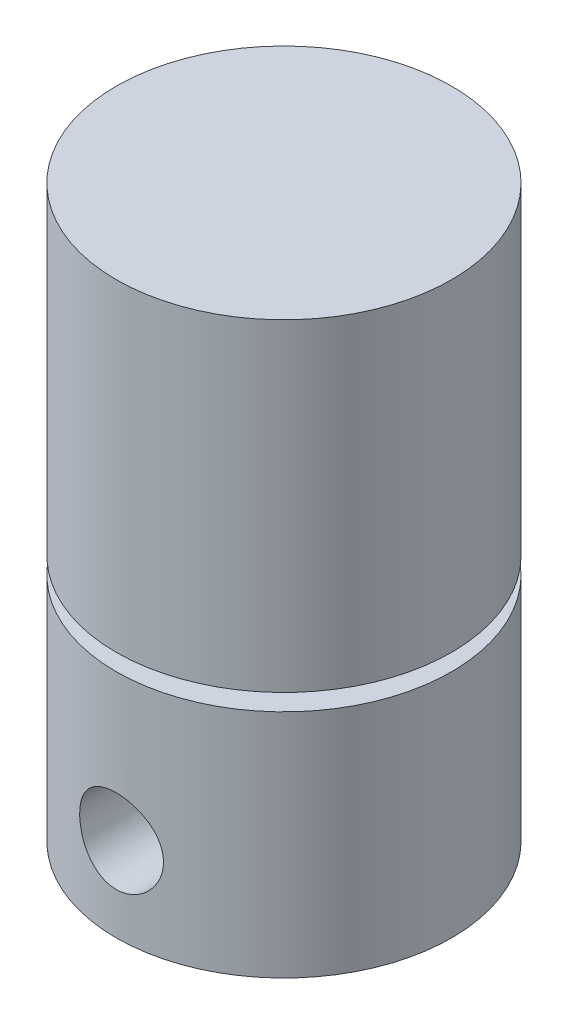
ISO-10303-21;
HEADER;
FILE_DESCRIPTION(('STEP AP214'),'2;1');
FILE_NAME('part.step','',(''),(''),'','','');
FILE_SCHEMA(('AUTOMOTIVE_DESIGN { 1 0 10303 214 1 1 1 1 }'));
ENDSEC;
DATA;
#1=APPLICATION_CONTEXT('core data for automotive mechanical design processes');
#2=APPLICATION_PROTOCOL_DEFINITION('international standard','automotive_design',2000,#1);
#3=PRODUCT_CONTEXT('',#1,'mechanical');
#4=PRODUCT('Part','Part','',(#3));
#5=PRODUCT_RELATED_PRODUCT_CATEGORY('part','',(#4));
#6=PRODUCT_DEFINITION_FORMATION('','',#4);
#7=PRODUCT_DEFINITION_CONTEXT('part definition',#1,'design');
#8=PRODUCT_DEFINITION('design','',#6,#7);
#9=PRODUCT_DEFINITION_SHAPE('','',#8);
#10=(LENGTH_UNIT() NAMED_UNIT(*) SI_UNIT(.MILLI.,.METRE.));
#11=(NAMED_UNIT(*) PLANE_ANGLE_UNIT() SI_UNIT($,.RADIAN.));
#12=(NAMED_UNIT(*) SI_UNIT($,.STERADIAN.) SOLID_ANGLE_UNIT());
#13=UNCERTAINTY_MEASURE_WITH_UNIT(LENGTH_MEASURE(1.E-05),#10,'distance_accuracy_value','');
#14=(GEOMETRIC_REPRESENTATION_CONTEXT(3) GLOBAL_UNCERTAINTY_ASSIGNED_CONTEXT((#13)) GLOBAL_UNIT_ASSIGNED_CONTEXT((#10,
#11,#12)) REPRESENTATION_CONTEXT('',''));
#15=CARTESIAN_POINT('',(0.,0.,0.));
#16=DIRECTION('',(0.,0.,1.));
#17=DIRECTION('',(1.,0.,0.));
#18=AXIS2_PLACEMENT_3D('',#15,#16,#17);
#19=CARTESIAN_POINT('',(0.,17.4625,0.));
#20=DIRECTION('',(0.,-1.,0.));
#21=DIRECTION('',(0.,0.,-1.));
#22=AXIS2_PLACEMENT_3D('',#19,#20,#21);
#23=CYLINDRICAL_SURFACE('',#22,12.7);
#24=CARTESIAN_POINT('',(3.175,6.35,-12.2967221242085));
#25=CARTESIAN_POINT('',(3.1749950198132,6.17467554632325,-12.2967254711158));
#26=CARTESIAN_POINT('',(3.16042833178202,5.99929597867828,-12.3005126863854));
#27=CARTESIAN_POINT('',(3.10263936933902,5.65357317571964,-12.3152136473056));
#28=CARTESIAN_POINT('',(3.05940041756247,5.4832329318254,-12.3261315404947));
#29=CARTESIAN_POINT('',(2.94575382353269,5.15263950650228,-12.3537818023711));
#30=CARTESIAN_POINT('',(2.8753812543752,4.99237361266015,-12.3705066621688));
#31=CARTESIAN_POINT('',(2.70957184940196,4.68590521727435,-12.4078770387652));
#32=CARTESIAN_POINT('',(2.61413394947207,4.53970331315812,-12.4285227220068));
#33=CARTESIAN_POINT('',(2.39865970268609,4.26229571051699,-12.4719170977164));
#34=CARTESIAN_POINT('',(2.27817284738414,4.13144512755544,-12.4946993898125));
#35=CARTESIAN_POINT('',(2.01699122140784,3.89158302916237,-12.5395085190442));
#36=CARTESIAN_POINT('',(1.87629456360899,3.78257355546038,-12.5615352853931));
#37=CARTESIAN_POINT('',(1.57625440537027,3.58803515610828,-12.6027232771114));
#38=CARTESIAN_POINT('',(1.4166781117678,3.50285508703494,-12.6218402299875));
#39=CARTESIAN_POINT('',(1.08491424405181,3.36066175192558,-12.65467131146));
#40=CARTESIAN_POINT('',(0.912728534955764,3.3036443300673,-12.6683862371462));
#41=CARTESIAN_POINT('',(0.564335623617785,3.2205322500852,-12.6886304373719));
#42=CARTESIAN_POINT('',(0.388280553827199,3.19383455170524,-12.6952996518228));
#43=CARTESIAN_POINT('',(0.0340726004637171,3.17022685832005,-12.7011886451627));
#44=CARTESIAN_POINT('',(-0.144079969063347,3.17331245929381,-12.7004095254281));
#45=CARTESIAN_POINT('',(-0.493243384772329,3.20875005981768,-12.6915938059099));
#46=CARTESIAN_POINT('',(-0.664324984533387,3.2404511328184,-12.6837186297291));
#47=CARTESIAN_POINT('',(-0.998658935538454,3.33117351296159,-12.6617836238657));
#48=CARTESIAN_POINT('',(-1.16191086950114,3.39019627442931,-12.6477234649603));
#49=CARTESIAN_POINT('',(-1.47766628361824,3.53441326477257,-12.6147513732012));
#50=CARTESIAN_POINT('',(-1.63005931850865,3.61983914672042,-12.5957967501266));
#51=CARTESIAN_POINT('',(-1.91857510093105,3.81426171247765,-12.5550917783831));
#52=CARTESIAN_POINT('',(-2.05469501139648,3.923262497072,-12.5333409435887));
#53=CARTESIAN_POINT('',(-2.31068256139473,4.16523010231761,-12.4887191648708));
#54=CARTESIAN_POINT('',(-2.43001063106375,4.29876571328164,-12.4658338379713));
#55=CARTESIAN_POINT('',(-2.64469999368259,4.58419196639616,-12.4220610526701));
#56=CARTESIAN_POINT('',(-2.74006016644614,4.7360834659537,-12.4011736876753));
#57=CARTESIAN_POINT('',(-2.90445230964671,5.05496834336905,-12.3637103097324));
#58=CARTESIAN_POINT('',(-2.97335437513118,5.22203137749726,-12.347155693206));
#59=CARTESIAN_POINT('',(-3.08192684552051,5.56588354445759,-12.3205067298881));
#60=CARTESIAN_POINT('',(-3.12160350580598,5.74267058726044,-12.3104110007027));
#61=CARTESIAN_POINT('',(-3.16970364110572,6.095948566943,-12.2981130212947));
#62=CARTESIAN_POINT('',(-3.17892490187728,6.2723239975431,-12.2957093300071));
#63=CARTESIAN_POINT('',(-3.16803657795425,6.62409385946327,-12.2985192607316));
#64=CARTESIAN_POINT('',(-3.14792969326925,6.79948837959579,-12.3037321815428));
#65=CARTESIAN_POINT('',(-3.07965533920158,7.14135511648469,-12.3209949412092));
#66=CARTESIAN_POINT('',(-3.03195236671802,7.30792636274288,-12.3329315220802));
#67=CARTESIAN_POINT('',(-2.91035496372149,7.63070795147373,-12.3621891219376));
#68=CARTESIAN_POINT('',(-2.83645743059488,7.78691706400085,-12.3795107787294));
#69=CARTESIAN_POINT('',(-2.66289874827948,8.08792042289096,-12.418010941113));
#70=CARTESIAN_POINT('',(-2.56276062737126,8.23243062685459,-12.439258441312));
#71=CARTESIAN_POINT('',(-2.34016643006688,8.50288922075787,-12.4830469550031));
#72=CARTESIAN_POINT('',(-2.21770668600727,8.62883455414564,-12.5055881806495));
#73=CARTESIAN_POINT('',(-1.95028413912651,8.86182002406507,-12.5501070185035));
#74=CARTESIAN_POINT('',(-1.80483494928781,8.96830827943698,-12.5720564161859));
#75=CARTESIAN_POINT('',(-1.49765601755559,9.15534855102809,-12.6123346509939));
#76=CARTESIAN_POINT('',(-1.33592712544035,9.23590192009242,-12.6306636769502));
#77=CARTESIAN_POINT('',(-1.00189729049621,9.36808646385047,-12.6615204698767));
#78=CARTESIAN_POINT('',(-0.829682684763527,9.41992564116141,-12.6740898412846));
#79=CARTESIAN_POINT('',(-0.478630489012213,9.49383462495269,-12.6921932261265));
#80=CARTESIAN_POINT('',(-0.299794184005939,9.51591017659858,-12.6977285972965));
#81=CARTESIAN_POINT('',(0.0542401964575508,9.52934209690234,-12.7010848787296));
#82=CARTESIAN_POINT('',(0.229405900617119,9.52151292637792,-12.6991103294396));
#83=CARTESIAN_POINT('',(0.575841801116834,9.47722314834044,-12.6881222125238));
#84=CARTESIAN_POINT('',(0.747112113154448,9.44076339233319,-12.6791088542401));
#85=CARTESIAN_POINT('',(1.08004303817216,9.34068420222751,-12.655087493111));
#86=CARTESIAN_POINT('',(1.24175042029424,9.27721203572685,-12.640112022951));
#87=CARTESIAN_POINT('',(1.55231164340716,9.12504341161286,-12.6057434230086));
#88=CARTESIAN_POINT('',(1.70116386101839,9.03634377427121,-12.5863497364056));
#89=CARTESIAN_POINT('',(1.98565112274399,8.83375413206227,-12.5446551773491));
#90=CARTESIAN_POINT('',(2.12088408784722,8.71931154628034,-12.5222957878978));
#91=CARTESIAN_POINT('',(2.37050268936837,8.46955744497192,-12.4774531075658));
#92=CARTESIAN_POINT('',(2.48488303211817,8.33424064634706,-12.4549697867118));
#93=CARTESIAN_POINT('',(2.69164443404806,8.04354050994846,-12.4119473580947));
#94=CARTESIAN_POINT('',(2.783575266647,7.88782990831532,-12.3914523466269));
#95=CARTESIAN_POINT('',(2.93981789665887,7.56267381964745,-12.3553205869608));
#96=CARTESIAN_POINT('',(3.00414978846308,7.39323843265204,-12.3396803064045));
#97=CARTESIAN_POINT('',(3.09379152821293,7.07841798742337,-12.3174731028359));
#98=CARTESIAN_POINT('',(3.12417831664509,6.93453920307402,-12.3097500503611));
#99=CARTESIAN_POINT('',(3.16478377891537,6.64378634093234,-12.2993733749982));
#100=CARTESIAN_POINT('',(3.17500417313031,6.49691251972402,-12.2967193196792));
#101=CARTESIAN_POINT('',(3.175,6.35,-12.2967221242085));
#102=B_SPLINE_CURVE_WITH_KNOTS('',3,(#24,#25,#26,#27,#28,#29,#30,#31,#32,#33,#34,#35,#36,#37,
#38,#39,#40,#41,#42,#43,#44,#45,#46,#47,#48,#49,#50,#51,#52,#53,#54,#55,#56,#57,#58,#59,#60,#61,
#62,#63,#64,#65,#66,#67,#68,#69,#70,#71,#72,#73,#74,#75,#76,#77,#78,#79,#80,#81,#82,#83,#84,#85,
#86,#87,#88,#89,#90,#91,#92,#93,#94,#95,#96,#97,#98,#99,#100,#101),.UNSPECIFIED.,.T.,.F.,(4,2,2,
2,2,2,2,2,2,2,2,2,2,2,2,2,2,2,2,2,2,2,2,2,2,2,2,2,2,2,2,2,2,2,2,2,2,2,4),(0.,0.525433851004893,
1.05117359161441,1.57623602350085,2.10132074979458,2.6368242182508,3.1723777227943,
3.71540400425358,4.25835013005807,4.7902971376409,5.32216548805846,5.84223193614963,
6.36232607040478,6.88711950303144,7.4120042954552,7.95109492546328,8.49021074623749,
9.03194068650671,9.57355464164525,10.1008633995054,10.6281236152971,11.1467570436797,
11.6654519221148,12.1943221424741,12.7232793399029,13.2654717033223,13.8076357797011,
14.3458193247108,14.8838989712076,15.4074297658815,15.9309449907505,16.4516419323711,
16.9724045329363,17.5056431266551,18.0390169009448,18.5823412615974,19.1252693614627,
19.5655924052587,20.0058778838705),.UNSPECIFIED.);
#103=CARTESIAN_POINT('',(3.175,6.35,-12.2967221242085));
#104=VERTEX_POINT('',#103);
#105=EDGE_CURVE('E61',#104,#104,#102,.T.);
#106=ORIENTED_EDGE('',*,*,#105,.F.);
#107=EDGE_LOOP('',(#106));
#108=FACE_BOUND('',#107,.T.);
#109=CARTESIAN_POINT('',(0.,17.4625,0.));
#110=DIRECTION('',(0.,1.,0.));
#111=DIRECTION('',(0.,0.,1.));
#112=AXIS2_PLACEMENT_3D('',#109,#110,#111);
#113=CIRCLE('',#112,12.7);
#114=CARTESIAN_POINT('',(0.,17.4625,12.7));
#115=VERTEX_POINT('',#114);
#116=EDGE_CURVE('E37',#115,#115,#113,.T.);
#117=ORIENTED_EDGE('',*,*,#116,.F.);
#118=EDGE_LOOP('',(#117));
#119=FACE_BOUND('',#118,.T.);
#120=CARTESIAN_POINT('',(0.,0.,0.));
#121=DIRECTION('',(0.,1.,0.));
#122=DIRECTION('',(0.,0.,1.));
#123=AXIS2_PLACEMENT_3D('',#120,#121,#122);
#124=CIRCLE('',#123,12.7);
#125=CARTESIAN_POINT('',(0.,0.,12.7));
#126=VERTEX_POINT('',#125);
#127=EDGE_CURVE('E33',#126,#126,#124,.T.);
#128=ORIENTED_EDGE('',*,*,#127,.T.);
#129=EDGE_LOOP('',(#128));
#130=FACE_BOUND('',#129,.T.);
#131=CARTESIAN_POINT('',(-3.175,6.35,12.2967221242085));
#132=CARTESIAN_POINT('',(-3.1749950198132,6.52532445367675,12.2967254711158));
#133=CARTESIAN_POINT('',(-3.16042833178202,6.70070402132172,12.3005126863854));
#134=CARTESIAN_POINT('',(-3.10263936933902,7.04642682428036,12.3152136473056));
#135=CARTESIAN_POINT('',(-3.05940041756247,7.21676706817459,12.3261315404947));
#136=CARTESIAN_POINT('',(-2.94575382353269,7.54736049349772,12.3537818023711));
#137=CARTESIAN_POINT('',(-2.8753812543752,7.70762638733985,12.3705066621688));
#138=CARTESIAN_POINT('',(-2.70957184940196,8.01409478272565,12.4078770387652));
#139=CARTESIAN_POINT('',(-2.61413394947207,8.16029668684188,12.4285227220068));
#140=CARTESIAN_POINT('',(-2.39865970268609,8.43770428948301,12.4719170977164));
#141=CARTESIAN_POINT('',(-2.27817284738414,8.56855487244456,12.4946993898125));
#142=CARTESIAN_POINT('',(-2.01699122140784,8.80841697083763,12.5395085190442));
#143=CARTESIAN_POINT('',(-1.87629456360899,8.91742644453962,12.5615352853931));
#144=CARTESIAN_POINT('',(-1.57625440537027,9.11196484389172,12.6027232771114));
#145=CARTESIAN_POINT('',(-1.4166781117678,9.19714491296506,12.6218402299875));
#146=CARTESIAN_POINT('',(-1.08491424405181,9.33933824807441,12.65467131146));
#147=CARTESIAN_POINT('',(-0.912728534955763,9.3963556699327,12.6683862371462));
#148=CARTESIAN_POINT('',(-0.564335623617784,9.4794677499148,12.6886304373719));
#149=CARTESIAN_POINT('',(-0.388280553827198,9.50616544829476,12.6952996518228));
#150=CARTESIAN_POINT('',(-0.0340726004637166,9.52977314167995,12.7011886451627));
#151=CARTESIAN_POINT('',(0.144079969063347,9.52668754070619,12.7004095254281));
#152=CARTESIAN_POINT('',(0.493243384772329,9.49124994018232,12.6915938059099));
#153=CARTESIAN_POINT('',(0.664324984533387,9.4595488671816,12.6837186297291));
#154=CARTESIAN_POINT('',(0.998658935538454,9.3688264870384,12.6617836238657));
#155=CARTESIAN_POINT('',(1.16191086950114,9.30980372557069,12.6477234649603));
#156=CARTESIAN_POINT('',(1.47766628361824,9.16558673522743,12.6147513732012));
#157=CARTESIAN_POINT('',(1.63005931850865,9.08016085327958,12.5957967501266));
#158=CARTESIAN_POINT('',(1.91857510093105,8.88573828752235,12.5550917783831));
#159=CARTESIAN_POINT('',(2.05469501139648,8.776737502928,12.5333409435887));
#160=CARTESIAN_POINT('',(2.31068256139473,8.53476989768239,12.4887191648708));
#161=CARTESIAN_POINT('',(2.43001063106375,8.40123428671837,12.4658338379713));
#162=CARTESIAN_POINT('',(2.64469999368259,8.11580803360384,12.4220610526701));
#163=CARTESIAN_POINT('',(2.74006016644614,7.9639165340463,12.4011736876753));
#164=CARTESIAN_POINT('',(2.90445230964671,7.64503165663095,12.3637103097324));
#165=CARTESIAN_POINT('',(2.97335437513118,7.47796862250274,12.347155693206));
#166=CARTESIAN_POINT('',(3.08192684552051,7.13411645554241,12.3205067298881));
#167=CARTESIAN_POINT('',(3.12160350580598,6.95732941273956,12.3104110007027));
#168=CARTESIAN_POINT('',(3.16970364110572,6.604051433057,12.2981130212947));
#169=CARTESIAN_POINT('',(3.17892490187728,6.4276760024569,12.2957093300071));
#170=CARTESIAN_POINT('',(3.16803657795425,6.07590614053673,12.2985192607316));
#171=CARTESIAN_POINT('',(3.14792969326925,5.90051162040421,12.3037321815428));
#172=CARTESIAN_POINT('',(3.07965533920158,5.55864488351531,12.3209949412092));
#173=CARTESIAN_POINT('',(3.03195236671802,5.39207363725712,12.3329315220802));
#174=CARTESIAN_POINT('',(2.91035496372149,5.06929204852627,12.3621891219376));
#175=CARTESIAN_POINT('',(2.83645743059488,4.91308293599915,12.3795107787294));
#176=CARTESIAN_POINT('',(2.66289874827948,4.61207957710904,12.418010941113));
#177=CARTESIAN_POINT('',(2.56276062737126,4.46756937314542,12.439258441312));
#178=CARTESIAN_POINT('',(2.34016643006688,4.19711077924213,12.4830469550031));
#179=CARTESIAN_POINT('',(2.21770668600727,4.07116544585436,12.5055881806495));
#180=CARTESIAN_POINT('',(1.95028413912651,3.83817997593493,12.5501070185035));
#181=CARTESIAN_POINT('',(1.80483494928781,3.73169172056302,12.5720564161859));
#182=CARTESIAN_POINT('',(1.49765601755559,3.54465144897191,12.6123346509939));
#183=CARTESIAN_POINT('',(1.33592712544035,3.46409807990758,12.6306636769502));
#184=CARTESIAN_POINT('',(1.00189729049621,3.33191353614953,12.6615204698767));
#185=CARTESIAN_POINT('',(0.829682684763526,3.28007435883859,12.6740898412846));
#186=CARTESIAN_POINT('',(0.478630489012213,3.20616537504731,12.6921932261265));
#187=CARTESIAN_POINT('',(0.299794184005939,3.18408982340142,12.6977285972965));
#188=CARTESIAN_POINT('',(-0.0542401964575509,3.17065790309766,12.7010848787296));
#189=CARTESIAN_POINT('',(-0.229405900617119,3.17848707362208,12.6991103294396));
#190=CARTESIAN_POINT('',(-0.575841801116834,3.22277685165956,12.6881222125238));
#191=CARTESIAN_POINT('',(-0.747112113154448,3.25923660766681,12.6791088542401));
#192=CARTESIAN_POINT('',(-1.08004303817216,3.35931579777248,12.655087493111));
#193=CARTESIAN_POINT('',(-1.24175042029424,3.42278796427315,12.640112022951));
#194=CARTESIAN_POINT('',(-1.55231164340716,3.57495658838714,12.6057434230086));
#195=CARTESIAN_POINT('',(-1.70116386101839,3.66365622572879,12.5863497364056));
#196=CARTESIAN_POINT('',(-1.98565112274399,3.86624586793772,12.5446551773491));
#197=CARTESIAN_POINT('',(-2.12088408784722,3.98068845371966,12.5222957878978));
#198=CARTESIAN_POINT('',(-2.37050268936837,4.23044255502808,12.4774531075658));
#199=CARTESIAN_POINT('',(-2.48488303211817,4.36575935365294,12.4549697867118));
#200=CARTESIAN_POINT('',(-2.69164443404806,4.65645949005154,12.4119473580947));
#201=CARTESIAN_POINT('',(-2.783575266647,4.81217009168468,12.3914523466269));
#202=CARTESIAN_POINT('',(-2.93981789665886,5.13732618035255,12.3553205869608));
#203=CARTESIAN_POINT('',(-3.00414978846308,5.30676156734796,12.3396803064045));
#204=CARTESIAN_POINT('',(-3.09379152821293,5.62158201257663,12.3174731028359));
#205=CARTESIAN_POINT('',(-3.12417831664509,5.76546079692598,12.3097500503611));
#206=CARTESIAN_POINT('',(-3.16478377891537,6.05621365906766,12.2993733749982));
#207=CARTESIAN_POINT('',(-3.17500417313031,6.20308748027598,12.2967193196792));
#208=CARTESIAN_POINT('',(-3.175,6.35,12.2967221242085));
#209=B_SPLINE_CURVE_WITH_KNOTS('',3,(#131,#132,#133,#134,#135,#136,#137,#138,#139,#140,#141,
#142,#143,#144,#145,#146,#147,#148,#149,#150,#151,#152,#153,#154,#155,#156,#157,#158,#159,#160,
#161,#162,#163,#164,#165,#166,#167,#168,#169,#170,#171,#172,#173,#174,#175,#176,#177,#178,#179,
#180,#181,#182,#183,#184,#185,#186,#187,#188,#189,#190,#191,#192,#193,#194,#195,#196,#197,#198,
#199,#200,#201,#202,#203,#204,#205,#206,#207,#208),.UNSPECIFIED.,.T.,.F.,(4,2,2,2,2,2,2,2,2,2,2,
2,2,2,2,2,2,2,2,2,2,2,2,2,2,2,2,2,2,2,2,2,2,2,2,2,2,2,4),(0.,0.525433851004893,1.05117359161441,
1.57623602350085,2.10132074979458,2.6368242182508,3.1723777227943,3.71540400425358,
4.25835013005807,4.7902971376409,5.32216548805846,5.84223193614962,6.36232607040478,
6.88711950303144,7.4120042954552,7.95109492546327,8.49021074623748,9.03194068650671,
9.57355464164525,10.1008633995054,10.6281236152971,11.1467570436797,11.6654519221148,
12.1943221424741,12.7232793399029,13.2654717033223,13.8076357797011,14.3458193247108,
14.8838989712076,15.4074297658815,15.9309449907505,16.4516419323711,16.9724045329363,
17.5056431266551,18.0390169009448,18.5823412615974,19.1252693614627,19.5655924052587,
20.0058778838705),.UNSPECIFIED.);
#210=CARTESIAN_POINT('',(-3.175,6.35,12.2967221242085));
#211=VERTEX_POINT('',#210);
#212=EDGE_CURVE('E53',#211,#211,#209,.T.);
#213=ORIENTED_EDGE('',*,*,#212,.T.);
#214=EDGE_LOOP('',(#213));
#215=FACE_BOUND('',#214,.T.);
#216=ADVANCED_FACE('F30',(#108,#119,#130,#215),#23,.T.);
#217=CARTESIAN_POINT('',(0.,17.4625,0.));
#218=DIRECTION('',(0.,1.,0.));
#219=DIRECTION('',(0.,0.,1.));
#220=AXIS2_PLACEMENT_3D('',#217,#218,#219);
#221=PLANE('',#220);
#222=CARTESIAN_POINT('',(0.,17.4625,0.));
#223=DIRECTION('',(0.,1.,0.));
#224=DIRECTION('',(0.,0.,1.));
#225=AXIS2_PLACEMENT_3D('',#222,#223,#224);
#226=CIRCLE('',#225,9.525);
#227=CARTESIAN_POINT('',(0.,17.4625,9.525));
#228=VERTEX_POINT('',#227);
#229=EDGE_CURVE('E10',#228,#228,#226,.T.);
#230=ORIENTED_EDGE('',*,*,#229,.F.);
#231=EDGE_LOOP('',(#230));
#232=FACE_BOUND('',#231,.T.);
#233=ORIENTED_EDGE('',*,*,#116,.T.);
#234=EDGE_LOOP('',(#233));
#235=FACE_BOUND('',#234,.T.);
#236=ADVANCED_FACE('F85',(#232,#235),#221,.T.);
#237=CARTESIAN_POINT('',(0.,0.,0.));
#238=DIRECTION('',(0.,1.,0.));
#239=DIRECTION('',(0.,0.,1.));
#240=AXIS2_PLACEMENT_3D('',#237,#238,#239);
#241=PLANE('',#240);
#242=CARTESIAN_POINT('',(9.525,0.,0.));
#243=DIRECTION('',(0.,-1.,0.));
#244=DIRECTION('',(0.,0.,-1.));
#245=AXIS2_PLACEMENT_3D('',#242,#243,#244);
#246=CIRCLE('',#245,1.5875);
#247=CARTESIAN_POINT('',(9.525,0.,-1.5875));
#248=VERTEX_POINT('',#247);
#249=EDGE_CURVE('E229',#248,#248,#246,.T.);
#250=ORIENTED_EDGE('',*,*,#249,.F.);
#251=EDGE_LOOP('',(#250));
#252=FACE_BOUND('',#251,.T.);
#253=CARTESIAN_POINT('',(-9.525,0.,0.));
#254=DIRECTION('',(0.,-1.,0.));
#255=DIRECTION('',(0.,0.,1.));
#256=AXIS2_PLACEMENT_3D('',#253,#254,#255);
#257=CIRCLE('',#256,1.5875);
#258=CARTESIAN_POINT('',(-9.525,0.,1.5875));
#259=VERTEX_POINT('',#258);
#260=EDGE_CURVE('E223',#259,#259,#257,.T.);
#261=ORIENTED_EDGE('',*,*,#260,.F.);
#262=EDGE_LOOP('',(#261));
#263=FACE_BOUND('',#262,.T.);
#264=ORIENTED_EDGE('',*,*,#127,.F.);
#265=EDGE_LOOP('',(#264));
#266=FACE_BOUND('',#265,.T.);
#267=ADVANCED_FACE('F90',(#252,#263,#266),#241,.F.);
#268=CARTESIAN_POINT('',(0.,18.7325,0.));
#269=DIRECTION('',(0.,-1.,0.));
#270=DIRECTION('',(0.,0.,-1.));
#271=AXIS2_PLACEMENT_3D('',#268,#269,#270);
#272=CYLINDRICAL_SURFACE('',#271,9.525);
#273=CARTESIAN_POINT('',(0.,18.7325,0.));
#274=DIRECTION('',(0.,1.,0.));
#275=DIRECTION('',(0.,0.,1.));
#276=AXIS2_PLACEMENT_3D('',#273,#274,#275);
#277=CIRCLE('',#276,9.525);
#278=CARTESIAN_POINT('',(0.,18.7325,9.525));
#279=VERTEX_POINT('',#278);
#280=EDGE_CURVE('E43',#279,#279,#277,.T.);
#281=ORIENTED_EDGE('',*,*,#280,.F.);
#282=EDGE_LOOP('',(#281));
#283=FACE_BOUND('',#282,.T.);
#284=ORIENTED_EDGE('',*,*,#229,.T.);
#285=EDGE_LOOP('',(#284));
#286=FACE_BOUND('',#285,.T.);
#287=ADVANCED_FACE('F105',(#283,#286),#272,.T.);
#288=CARTESIAN_POINT('',(0.,43.18,0.));
#289=DIRECTION('',(0.,-1.,0.));
#290=DIRECTION('',(0.,0.,-1.));
#291=AXIS2_PLACEMENT_3D('',#288,#289,#290);
#292=CYLINDRICAL_SURFACE('',#291,12.7);
#293=CARTESIAN_POINT('',(0.,43.18,0.));
#294=DIRECTION('',(0.,1.,0.));
#295=DIRECTION('',(0.,0.,1.));
#296=AXIS2_PLACEMENT_3D('',#293,#294,#295);
#297=CIRCLE('',#296,12.7);
#298=CARTESIAN_POINT('',(0.,43.18,12.7));
#299=VERTEX_POINT('',#298);
#300=EDGE_CURVE('E46',#299,#299,#297,.T.);
#301=ORIENTED_EDGE('',*,*,#300,.F.);
#302=EDGE_LOOP('',(#301));
#303=FACE_BOUND('',#302,.T.);
#304=CARTESIAN_POINT('',(0.,18.7325,0.));
#305=DIRECTION('',(0.,1.,0.));
#306=DIRECTION('',(0.,0.,1.));
#307=AXIS2_PLACEMENT_3D('',#304,#305,#306);
#308=CIRCLE('',#307,12.7);
#309=CARTESIAN_POINT('',(0.,18.7325,12.7));
#310=VERTEX_POINT('',#309);
#311=EDGE_CURVE('E47',#310,#310,#308,.T.);
#312=ORIENTED_EDGE('',*,*,#311,.T.);
#313=EDGE_LOOP('',(#312));
#314=FACE_BOUND('',#313,.T.);
#315=ADVANCED_FACE('F110',(#303,#314),#292,.T.);
#316=CARTESIAN_POINT('',(0.,43.18,0.));
#317=DIRECTION('',(0.,1.,0.));
#318=DIRECTION('',(0.,0.,1.));
#319=AXIS2_PLACEMENT_3D('',#316,#317,#318);
#320=PLANE('',#319);
#321=ORIENTED_EDGE('',*,*,#300,.T.);
#322=EDGE_LOOP('',(#321));
#323=FACE_BOUND('',#322,.T.);
#324=ADVANCED_FACE('F118',(#323),#320,.T.);
#325=CARTESIAN_POINT('',(0.,18.7325,0.));
#326=DIRECTION('',(0.,1.,0.));
#327=DIRECTION('',(0.,0.,1.));
#328=AXIS2_PLACEMENT_3D('',#325,#326,#327);
#329=PLANE('',#328);
#330=ORIENTED_EDGE('',*,*,#280,.T.);
#331=EDGE_LOOP('',(#330));
#332=FACE_BOUND('',#331,.T.);
#333=ORIENTED_EDGE('',*,*,#311,.F.);
#334=EDGE_LOOP('',(#333));
#335=FACE_BOUND('',#334,.T.);
#336=ADVANCED_FACE('F81',(#332,#335),#329,.F.);
#337=CARTESIAN_POINT('',(0.,6.35,12.701));
#338=DIRECTION('',(0.,0.,-1.));
#339=DIRECTION('',(-1.,0.,0.));
#340=AXIS2_PLACEMENT_3D('',#337,#338,#339);
#341=CYLINDRICAL_SURFACE('',#340,3.175);
#342=CARTESIAN_POINT('',(0.,6.35,6.35));
#343=DIRECTION('',(0.,0.,1.));
#344=DIRECTION('',(1.,0.,0.));
#345=AXIS2_PLACEMENT_3D('',#342,#343,#344);
#346=CIRCLE('',#345,3.175);
#347=CARTESIAN_POINT('',(3.175,6.35,6.35));
#348=VERTEX_POINT('',#347);
#349=EDGE_CURVE('E50',#348,#348,#346,.T.);
#350=ORIENTED_EDGE('',*,*,#349,.F.);
#351=EDGE_LOOP('',(#350));
#352=FACE_BOUND('',#351,.T.);
#353=ORIENTED_EDGE('',*,*,#212,.F.);
#354=EDGE_LOOP('',(#353));
#355=FACE_BOUND('',#354,.T.);
#356=ADVANCED_FACE('F63',(#352,#355),#341,.F.);
#357=CARTESIAN_POINT('',(0.,6.35,6.35));
#358=DIRECTION('',(0.,0.,1.));
#359=DIRECTION('',(1.,0.,0.));
#360=AXIS2_PLACEMENT_3D('',#357,#358,#359);
#361=PLANE('',#360);
#362=ORIENTED_EDGE('',*,*,#349,.T.);
#363=EDGE_LOOP('',(#362));
#364=FACE_BOUND('',#363,.T.);
#365=ADVANCED_FACE('F72',(#364),#361,.T.);
#366=CARTESIAN_POINT('',(0.,6.35,-12.701));
#367=DIRECTION('',(0.,0.,1.));
#368=DIRECTION('',(1.,0.,0.));
#369=AXIS2_PLACEMENT_3D('',#366,#367,#368);
#370=CYLINDRICAL_SURFACE('',#369,3.175);
#371=CARTESIAN_POINT('',(0.,6.35,-9.398));
#372=DIRECTION('',(0.,0.,1.));
#373=DIRECTION('',(1.,0.,0.));
#374=AXIS2_PLACEMENT_3D('',#371,#372,#373);
#375=CIRCLE('',#374,3.175);
#376=CARTESIAN_POINT('',(3.175,6.35,-9.398));
#377=VERTEX_POINT('',#376);
#378=EDGE_CURVE('E219',#377,#377,#375,.T.);
#379=ORIENTED_EDGE('',*,*,#378,.T.);
#380=EDGE_LOOP('',(#379));
#381=FACE_BOUND('',#380,.T.);
#382=ORIENTED_EDGE('',*,*,#105,.T.);
#383=EDGE_LOOP('',(#382));
#384=FACE_BOUND('',#383,.T.);
#385=ADVANCED_FACE('F69',(#381,#384),#370,.F.);
#386=CARTESIAN_POINT('',(0.,6.35,-9.398));
#387=DIRECTION('',(0.,0.,1.));
#388=DIRECTION('',(1.,0.,0.));
#389=AXIS2_PLACEMENT_3D('',#386,#387,#388);
#390=PLANE('',#389);
#391=ORIENTED_EDGE('',*,*,#378,.F.);
#392=EDGE_LOOP('',(#391));
#393=FACE_BOUND('',#392,.T.);
#394=ADVANCED_FACE('F79',(#393),#390,.F.);
#395=CARTESIAN_POINT('',(-9.525,6.35,0.));
#396=DIRECTION('',(0.,-1.,0.));
#397=DIRECTION('',(0.,0.,-1.));
#398=AXIS2_PLACEMENT_3D('',#395,#396,#397);
#399=CYLINDRICAL_SURFACE('',#398,1.5875);
#400=CARTESIAN_POINT('',(-9.525,6.35,0.));
#401=DIRECTION('',(0.,-1.,0.));
#402=DIRECTION('',(0.,0.,1.));
#403=AXIS2_PLACEMENT_3D('',#400,#401,#402);
#404=CIRCLE('',#403,1.5875);
#405=CARTESIAN_POINT('',(-9.525,6.35,1.5875));
#406=VERTEX_POINT('',#405);
#407=EDGE_CURVE('E226',#406,#406,#404,.T.);
#408=ORIENTED_EDGE('',*,*,#407,.F.);
#409=EDGE_LOOP('',(#408));
#410=FACE_BOUND('',#409,.T.);
#411=ORIENTED_EDGE('',*,*,#260,.T.);
#412=EDGE_LOOP('',(#411));
#413=FACE_BOUND('',#412,.T.);
#414=ADVANCED_FACE('F162',(#410,#413),#399,.F.);
#415=CARTESIAN_POINT('',(-9.525,6.35,0.));
#416=DIRECTION('',(0.,1.,0.));
#417=DIRECTION('',(0.,0.,1.));
#418=AXIS2_PLACEMENT_3D('',#415,#416,#417);
#419=PLANE('',#418);
#420=ORIENTED_EDGE('',*,*,#407,.T.);
#421=EDGE_LOOP('',(#420));
#422=FACE_BOUND('',#421,.T.);
#423=ADVANCED_FACE('F178',(#422),#419,.F.);
#424=CARTESIAN_POINT('',(9.525,6.35,0.));
#425=DIRECTION('',(0.,-1.,0.));
#426=DIRECTION('',(0.,0.,-1.));
#427=AXIS2_PLACEMENT_3D('',#424,#425,#426);
#428=CYLINDRICAL_SURFACE('',#427,1.5875);
#429=CARTESIAN_POINT('',(9.525,6.35,0.));
#430=DIRECTION('',(0.,-1.,0.));
#431=DIRECTION('',(0.,0.,-1.));
#432=AXIS2_PLACEMENT_3D('',#429,#430,#431);
#433=CIRCLE('',#432,1.5875);
#434=CARTESIAN_POINT('',(9.525,6.35,-1.5875));
#435=VERTEX_POINT('',#434);
#436=EDGE_CURVE('E222',#435,#435,#433,.T.);
#437=ORIENTED_EDGE('',*,*,#436,.F.);
#438=EDGE_LOOP('',(#437));
#439=FACE_BOUND('',#438,.T.);
#440=ORIENTED_EDGE('',*,*,#249,.T.);
#441=EDGE_LOOP('',(#440));
#442=FACE_BOUND('',#441,.T.);
#443=ADVANCED_FACE('F188',(#439,#442),#428,.F.);
#444=CARTESIAN_POINT('',(9.525,6.35,0.));
#445=DIRECTION('',(0.,-1.,0.));
#446=DIRECTION('',(0.,0.,-1.));
#447=AXIS2_PLACEMENT_3D('',#444,#445,#446);
#448=PLANE('',#447);
#449=ORIENTED_EDGE('',*,*,#436,.T.);
#450=EDGE_LOOP('',(#449));
#451=FACE_BOUND('',#450,.T.);
#452=ADVANCED_FACE('F198',(#451),#448,.T.);
#453=CLOSED_SHELL('',(#216,#236,#267,#287,#315,#324,#336,#356,#365,#385,#394,#414,#423,#443,#452));
#454=MANIFOLD_SOLID_BREP('B2',#453);
#455=ADVANCED_BREP_SHAPE_REPRESENTATION('',(#18,#454),#14);
#456=SHAPE_DEFINITION_REPRESENTATION(#9,#455);
ENDSEC;
END-ISO-10303-21;
